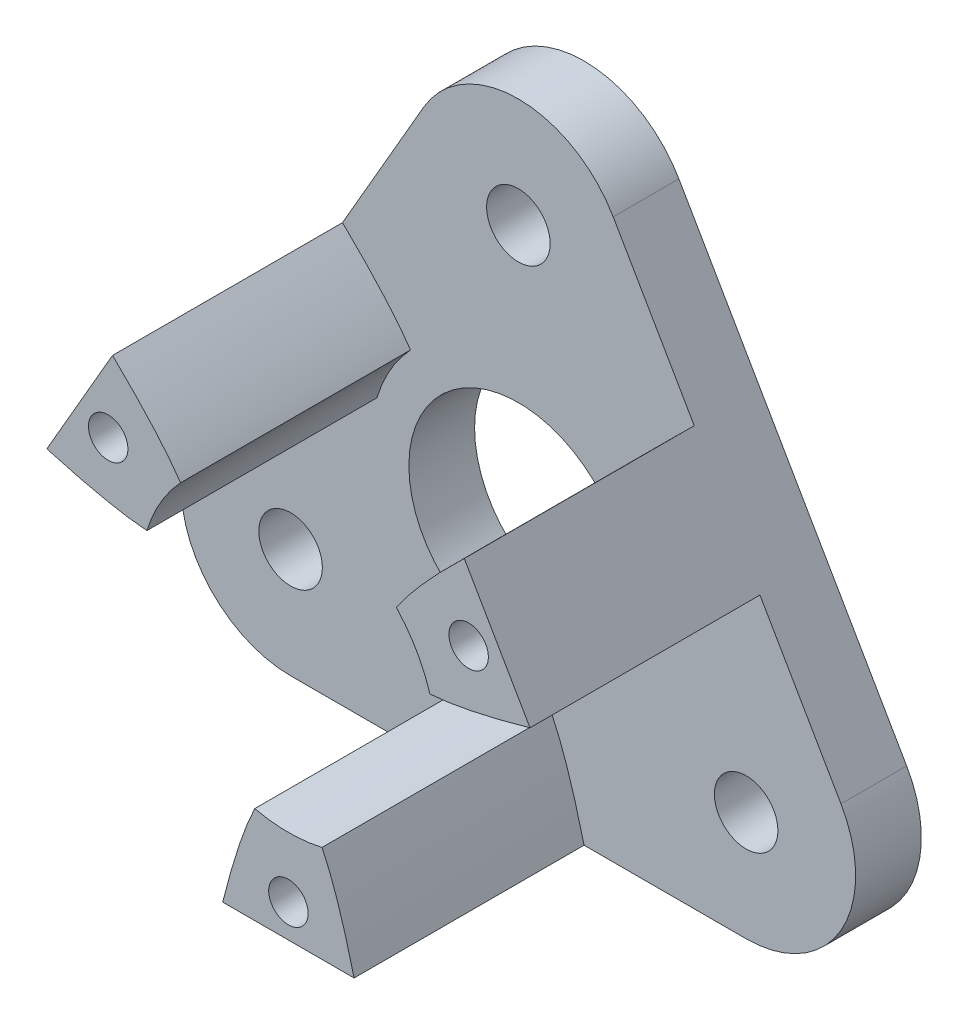
ISO-10303-21;
HEADER;
FILE_DESCRIPTION(('STEP AP214'),'2;1');
FILE_NAME('part.step','',(''),(''),'','','');
FILE_SCHEMA(('AUTOMOTIVE_DESIGN { 1 0 10303 214 1 1 1 1 }'));
ENDSEC;
DATA;
#1=APPLICATION_CONTEXT('core data for automotive mechanical design processes');
#2=APPLICATION_PROTOCOL_DEFINITION('international standard','automotive_design',2000,#1);
#3=PRODUCT_CONTEXT('',#1,'mechanical');
#4=PRODUCT('Part','Part','',(#3));
#5=PRODUCT_RELATED_PRODUCT_CATEGORY('part','',(#4));
#6=PRODUCT_DEFINITION_FORMATION('','',#4);
#7=PRODUCT_DEFINITION_CONTEXT('part definition',#1,'design');
#8=PRODUCT_DEFINITION('design','',#6,#7);
#9=PRODUCT_DEFINITION_SHAPE('','',#8);
#10=(LENGTH_UNIT() NAMED_UNIT(*) SI_UNIT(.MILLI.,.METRE.));
#11=(NAMED_UNIT(*) PLANE_ANGLE_UNIT() SI_UNIT($,.RADIAN.));
#12=(NAMED_UNIT(*) SI_UNIT($,.STERADIAN.) SOLID_ANGLE_UNIT());
#13=UNCERTAINTY_MEASURE_WITH_UNIT(LENGTH_MEASURE(1.E-05),#10,'distance_accuracy_value','');
#14=(GEOMETRIC_REPRESENTATION_CONTEXT(3) GLOBAL_UNCERTAINTY_ASSIGNED_CONTEXT((#13)) GLOBAL_UNIT_ASSIGNED_CONTEXT((#10,
#11,#12)) REPRESENTATION_CONTEXT('',''));
#15=CARTESIAN_POINT('',(0.,0.,0.));
#16=DIRECTION('',(0.,0.,1.));
#17=DIRECTION('',(1.,0.,0.));
#18=AXIS2_PLACEMENT_3D('',#15,#16,#17);
#19=CARTESIAN_POINT('',(8.03012701892221,8.1002976111394,13.5));
#20=CARTESIAN_POINT('',(-0.869872981077836,-0.50222139978608,13.5));
#21=CARTESIAN_POINT('',(11.0301270189222,2.90414518843278,13.5));
#22=B_SPLINE_CURVE_WITH_KNOTS('',2,(#19,#20,#21),.UNSPECIFIED.,.F.,.F.,(3,3),(0.,1.),.UNSPECIFIED.);
#23=DIRECTION('',(0.,0.,-1.));
#24=VECTOR('',#23,1.);
#25=SURFACE_OF_LINEAR_EXTRUSION('',#22,#24);
#26=DIRECTION('',(0.,0.,-1.));
#27=VECTOR('',#26,1.);
#28=CARTESIAN_POINT('',(4.92465367392024,4.61630655307291,13.5));
#29=LINE('',#28,#27);
#30=CARTESIAN_POINT('',(4.92465367392024,4.61630655307291,13.5));
#31=VERTEX_POINT('',#30);
#32=CARTESIAN_POINT('',(4.92465367392024,4.61630655307291,3.));
#33=VERTEX_POINT('',#32);
#34=EDGE_CURVE('E156',#31,#33,#29,.T.);
#35=ORIENTED_EDGE('',*,*,#34,.F.);
#36=CARTESIAN_POINT('',(8.03012701892221,8.1002976111394,13.5));
#37=VERTEX_POINT('',#36);
#38=EDGE_CURVE('E168',#37,#31,#22,.T.);
#39=ORIENTED_EDGE('',*,*,#38,.F.);
#40=DIRECTION('',(0.,0.,-1.));
#41=VECTOR('',#40,1.);
#42=CARTESIAN_POINT('',(8.03012701892221,8.1002976111394,13.5));
#43=LINE('',#42,#41);
#44=CARTESIAN_POINT('',(8.0301270189222,8.1002976111394,3.));
#45=VERTEX_POINT('',#44);
#46=EDGE_CURVE('E178',#37,#45,#43,.T.);
#47=ORIENTED_EDGE('',*,*,#46,.T.);
#48=CARTESIAN_POINT('',(8.03012701892221,8.1002976111394,3.));
#49=CARTESIAN_POINT('',(-0.869872981077836,-0.50222139978608,3.));
#50=CARTESIAN_POINT('',(11.0301270189222,2.90414518843278,3.));
#51=B_SPLINE_CURVE_WITH_KNOTS('',2,(#48,#49,#50),.UNSPECIFIED.,.F.,.F.,(3,3),(0.,1.),.UNSPECIFIED.);
#52=EDGE_CURVE('E169',#45,#33,#51,.T.);
#53=ORIENTED_EDGE('',*,*,#52,.T.);
#54=EDGE_LOOP('',(#35,#39,#47,#53));
#55=FACE_BOUND('',#54,.T.);
#56=ADVANCED_FACE('F32',(#55),#25,.F.);
#57=DIRECTION('',(0.,0.,-1.));
#58=VECTOR('',#57,1.);
#59=CARTESIAN_POINT('',(6.46016558357783,1.95672190991886,13.5));
#60=LINE('',#59,#58);
#61=CARTESIAN_POINT('',(6.46016558357783,1.95672190991886,3.));
#62=VERTEX_POINT('',#61);
#63=CARTESIAN_POINT('',(6.46016558357783,1.95672190991886,13.5));
#64=VERTEX_POINT('',#63);
#65=EDGE_CURVE('E47',#62,#64,#60,.F.);
#66=ORIENTED_EDGE('',*,*,#65,.F.);
#67=CARTESIAN_POINT('',(11.0301270189222,2.90414518843278,3.));
#68=VERTEX_POINT('',#67);
#69=EDGE_CURVE('E40',#62,#68,#51,.T.);
#70=ORIENTED_EDGE('',*,*,#69,.T.);
#71=DIRECTION('',(0.,0.,-1.));
#72=VECTOR('',#71,1.);
#73=CARTESIAN_POINT('',(11.0301270189222,2.90414518843278,13.5));
#74=LINE('',#73,#72);
#75=CARTESIAN_POINT('',(11.0301270189222,2.90414518843278,13.5));
#76=VERTEX_POINT('',#75);
#77=EDGE_CURVE('E414',#76,#68,#74,.T.);
#78=ORIENTED_EDGE('',*,*,#77,.F.);
#79=EDGE_CURVE('E176',#64,#76,#22,.T.);
#80=ORIENTED_EDGE('',*,*,#79,.F.);
#81=EDGE_LOOP('',(#66,#70,#78,#80));
#82=FACE_BOUND('',#81,.T.);
#83=ADVANCED_FACE('F194',(#82),#25,.F.);
#84=CARTESIAN_POINT('',(3.00000000000033,-11.0044427995723,13.5));
#85=CARTESIAN_POINT('',(-2.3763001115451E-13,1.00444279957233,13.5));
#86=CARTESIAN_POINT('',(-2.99999999999967,-11.0044427995723,13.5));
#87=B_SPLINE_CURVE_WITH_KNOTS('',2,(#84,#85,#86),.UNSPECIFIED.,.F.,.F.,(3,3),(0.,1.),.UNSPECIFIED.);
#88=DIRECTION('',(0.,0.,-1.));
#89=VECTOR('',#88,1.);
#90=SURFACE_OF_LINEAR_EXTRUSION('',#87,#89);
#91=DIRECTION('',(0.,0.,-1.));
#92=VECTOR('',#91,1.);
#93=CARTESIAN_POINT('',(1.53551190965768,-6.57302846299173,13.5));
#94=LINE('',#93,#92);
#95=CARTESIAN_POINT('',(1.53551190965768,-6.57302846299173,13.5));
#96=VERTEX_POINT('',#95);
#97=CARTESIAN_POINT('',(1.53551190965768,-6.57302846299173,3.));
#98=VERTEX_POINT('',#97);
#99=EDGE_CURVE('E467',#96,#98,#94,.T.);
#100=ORIENTED_EDGE('',*,*,#99,.F.);
#101=CARTESIAN_POINT('',(3.00000000000033,-11.0044427995723,13.5));
#102=VERTEX_POINT('',#101);
#103=EDGE_CURVE('E303',#102,#96,#87,.T.);
#104=ORIENTED_EDGE('',*,*,#103,.F.);
#105=DIRECTION('',(0.,0.,-1.));
#106=VECTOR('',#105,1.);
#107=CARTESIAN_POINT('',(3.00000000000033,-11.0044427995723,13.5));
#108=LINE('',#107,#106);
#109=CARTESIAN_POINT('',(3.00000000000033,-11.0044427995723,3.));
#110=VERTEX_POINT('',#109);
#111=EDGE_CURVE('E294',#102,#110,#108,.T.);
#112=ORIENTED_EDGE('',*,*,#111,.T.);
#113=CARTESIAN_POINT('',(3.00000000000033,-11.0044427995723,3.));
#114=CARTESIAN_POINT('',(-2.3763001115451E-13,1.00444279957233,3.));
#115=CARTESIAN_POINT('',(-2.99999999999967,-11.0044427995723,3.));
#116=B_SPLINE_CURVE_WITH_KNOTS('',2,(#113,#114,#115),.UNSPECIFIED.,.F.,.F.,(3,3),(0.,1.),.UNSPECIFIED.);
#117=EDGE_CURVE('E306',#110,#98,#116,.T.);
#118=ORIENTED_EDGE('',*,*,#117,.T.);
#119=EDGE_LOOP('',(#100,#104,#112,#118));
#120=FACE_BOUND('',#119,.T.);
#121=ADVANCED_FACE('F325',(#120),#90,.F.);
#122=DIRECTION('',(0.,0.,-1.));
#123=VECTOR('',#122,1.);
#124=CARTESIAN_POINT('',(-1.53551190965746,-6.57302846299178,13.5));
#125=LINE('',#124,#123);
#126=CARTESIAN_POINT('',(-1.53551190965746,-6.57302846299178,3.));
#127=VERTEX_POINT('',#126);
#128=CARTESIAN_POINT('',(-1.53551190965746,-6.57302846299178,13.5));
#129=VERTEX_POINT('',#128);
#130=EDGE_CURVE('E55',#127,#129,#125,.F.);
#131=ORIENTED_EDGE('',*,*,#130,.F.);
#132=CARTESIAN_POINT('',(-2.99999999999967,-11.0044427995721,3.));
#133=VERTEX_POINT('',#132);
#134=EDGE_CURVE('E310',#127,#133,#116,.T.);
#135=ORIENTED_EDGE('',*,*,#134,.T.);
#136=DIRECTION('',(0.,0.,-1.));
#137=VECTOR('',#136,1.);
#138=CARTESIAN_POINT('',(-2.99999999999967,-11.0044427995723,13.5));
#139=LINE('',#138,#137);
#140=CARTESIAN_POINT('',(-2.99999999999967,-11.0044427995723,13.5));
#141=VERTEX_POINT('',#140);
#142=EDGE_CURVE('E184',#141,#133,#139,.T.);
#143=ORIENTED_EDGE('',*,*,#142,.F.);
#144=EDGE_CURVE('E309',#129,#141,#87,.T.);
#145=ORIENTED_EDGE('',*,*,#144,.F.);
#146=EDGE_LOOP('',(#131,#135,#143,#145));
#147=FACE_BOUND('',#146,.T.);
#148=ADVANCED_FACE('F328',(#147),#90,.F.);
#149=CARTESIAN_POINT('',(-11.0301270189222,2.90414518843237,13.5));
#150=CARTESIAN_POINT('',(0.869872981077829,-0.502221399785746,13.5));
#151=CARTESIAN_POINT('',(-8.03012701892225,8.10029761113902,13.5));
#152=B_SPLINE_CURVE_WITH_KNOTS('',2,(#149,#150,#151),.UNSPECIFIED.,.F.,.F.,(3,3),(0.,1.),.UNSPECIFIED.);
#153=DIRECTION('',(0.,0.,-1.));
#154=VECTOR('',#153,1.);
#155=SURFACE_OF_LINEAR_EXTRUSION('',#152,#154);
#156=DIRECTION('',(0.,0.,-1.));
#157=VECTOR('',#156,1.);
#158=CARTESIAN_POINT('',(-6.46016558357787,1.95672190991873,13.5));
#159=LINE('',#158,#157);
#160=CARTESIAN_POINT('',(-6.46016558357787,1.95672190991873,13.5));
#161=VERTEX_POINT('',#160);
#162=CARTESIAN_POINT('',(-6.46016558357787,1.95672190991873,3.));
#163=VERTEX_POINT('',#162);
#164=EDGE_CURVE('E465',#161,#163,#159,.T.);
#165=ORIENTED_EDGE('',*,*,#164,.F.);
#166=CARTESIAN_POINT('',(-11.0301270189222,2.90414518843237,13.5));
#167=VERTEX_POINT('',#166);
#168=EDGE_CURVE('E340',#167,#161,#152,.T.);
#169=ORIENTED_EDGE('',*,*,#168,.F.);
#170=DIRECTION('',(0.,0.,-1.));
#171=VECTOR('',#170,1.);
#172=CARTESIAN_POINT('',(-11.0301270189222,2.90414518843237,13.5));
#173=LINE('',#172,#171);
#174=CARTESIAN_POINT('',(-11.0301270189222,2.90414518843237,3.));
#175=VERTEX_POINT('',#174);
#176=EDGE_CURVE('E353',#167,#175,#173,.T.);
#177=ORIENTED_EDGE('',*,*,#176,.T.);
#178=CARTESIAN_POINT('',(-11.0301270189222,2.90414518843237,3.));
#179=CARTESIAN_POINT('',(0.869872981077829,-0.502221399785746,3.));
#180=CARTESIAN_POINT('',(-8.03012701892225,8.10029761113902,3.));
#181=B_SPLINE_CURVE_WITH_KNOTS('',2,(#178,#179,#180),.UNSPECIFIED.,.F.,.F.,(3,3),(0.,1.),.UNSPECIFIED.);
#182=EDGE_CURVE('E354',#175,#163,#181,.T.);
#183=ORIENTED_EDGE('',*,*,#182,.T.);
#184=EDGE_LOOP('',(#165,#169,#177,#183));
#185=FACE_BOUND('',#184,.T.);
#186=ADVANCED_FACE('F334',(#185),#155,.F.);
#187=DIRECTION('',(0.,0.,-1.));
#188=VECTOR('',#187,1.);
#189=CARTESIAN_POINT('',(-4.9246536739203,4.61630655307284,13.5));
#190=LINE('',#189,#188);
#191=CARTESIAN_POINT('',(-4.9246536739203,4.61630655307284,3.));
#192=VERTEX_POINT('',#191);
#193=CARTESIAN_POINT('',(-4.92465367392029,4.61630655307283,13.5));
#194=VERTEX_POINT('',#193);
#195=EDGE_CURVE('E161',#192,#194,#190,.F.);
#196=ORIENTED_EDGE('',*,*,#195,.F.);
#197=CARTESIAN_POINT('',(-8.03012701892242,8.10029761113901,3.));
#198=VERTEX_POINT('',#197);
#199=EDGE_CURVE('E170',#192,#198,#181,.T.);
#200=ORIENTED_EDGE('',*,*,#199,.T.);
#201=DIRECTION('',(0.,0.,-1.));
#202=VECTOR('',#201,1.);
#203=CARTESIAN_POINT('',(-8.03012701892225,8.10029761113902,13.5));
#204=LINE('',#203,#202);
#205=CARTESIAN_POINT('',(-8.03012701892225,8.10029761113902,13.5));
#206=VERTEX_POINT('',#205);
#207=EDGE_CURVE('E320',#206,#198,#204,.T.);
#208=ORIENTED_EDGE('',*,*,#207,.F.);
#209=EDGE_CURVE('E347',#194,#206,#152,.T.);
#210=ORIENTED_EDGE('',*,*,#209,.F.);
#211=EDGE_LOOP('',(#196,#200,#208,#210));
#212=FACE_BOUND('',#211,.T.);
#213=ADVANCED_FACE('F217',(#212),#155,.F.);
#214=CARTESIAN_POINT('',(-10.4,-6.00444279957209,3.));
#215=DIRECTION('',(0.,0.,1.));
#216=DIRECTION('',(1.,0.,0.));
#217=AXIS2_PLACEMENT_3D('',#214,#215,#216);
#218=PLANE('',#217);
#219=CARTESIAN_POINT('',(10.4,-6.00444279957208,3.));
#220=DIRECTION('',(0.,0.,1.));
#221=DIRECTION('',(1.,0.,0.));
#222=AXIS2_PLACEMENT_3D('',#219,#220,#221);
#223=CIRCLE('',#222,1.45);
#224=CARTESIAN_POINT('',(11.85,-6.00444279957208,3.));
#225=VERTEX_POINT('',#224);
#226=EDGE_CURVE('E402',#225,#225,#223,.T.);
#227=ORIENTED_EDGE('',*,*,#226,.F.);
#228=EDGE_LOOP('',(#227));
#229=FACE_BOUND('',#228,.T.);
#230=ORIENTED_EDGE('',*,*,#69,.F.);
#231=CARTESIAN_POINT('',(0.,0.,3.));
#232=DIRECTION('',(0.,0.,1.));
#233=DIRECTION('',(1.,0.,0.));
#234=AXIS2_PLACEMENT_3D('',#231,#232,#233);
#235=CIRCLE('',#234,6.75);
#236=EDGE_CURVE('E422',#62,#33,#235,.T.);
#237=ORIENTED_EDGE('',*,*,#236,.T.);
#238=ORIENTED_EDGE('',*,*,#52,.F.);
#239=DIRECTION('',(-0.500000000000001,0.866025403784438,0.));
#240=VECTOR('',#239,1.);
#241=CARTESIAN_POINT('',(4.33012701892219,14.5088855991442,3.));
#242=LINE('',#241,#240);
#243=CARTESIAN_POINT('',(4.33012701892219,14.5088855991442,3.));
#244=VERTEX_POINT('',#243);
#245=EDGE_CURVE('E380',#45,#244,#242,.T.);
#246=ORIENTED_EDGE('',*,*,#245,.T.);
#247=CARTESIAN_POINT('',(0.,12.0088855991442,3.));
#248=DIRECTION('',(0.,0.,1.));
#249=DIRECTION('',(1.,0.,0.));
#250=AXIS2_PLACEMENT_3D('',#247,#248,#249);
#251=CIRCLE('',#250,5.);
#252=CARTESIAN_POINT('',(-4.33012701892219,14.5088855991442,3.));
#253=VERTEX_POINT('',#252);
#254=EDGE_CURVE('E387',#244,#253,#251,.T.);
#255=ORIENTED_EDGE('',*,*,#254,.T.);
#256=DIRECTION('',(-0.500000000000001,-0.866025403784438,0.));
#257=VECTOR('',#256,1.);
#258=CARTESIAN_POINT('',(-14.7301270189222,-3.50444279957208,3.));
#259=LINE('',#258,#257);
#260=EDGE_CURVE('E280',#253,#198,#259,.T.);
#261=ORIENTED_EDGE('',*,*,#260,.T.);
#262=ORIENTED_EDGE('',*,*,#199,.F.);
#263=EDGE_CURVE('E423',#192,#163,#235,.T.);
#264=ORIENTED_EDGE('',*,*,#263,.T.);
#265=ORIENTED_EDGE('',*,*,#182,.F.);
#266=CARTESIAN_POINT('',(-14.7301270189222,-3.50444279957208,3.));
#267=VERTEX_POINT('',#266);
#268=EDGE_CURVE('E389',#175,#267,#259,.T.);
#269=ORIENTED_EDGE('',*,*,#268,.T.);
#270=CARTESIAN_POINT('',(-10.4,-6.00444279957209,3.));
#271=DIRECTION('',(0.,0.,1.));
#272=DIRECTION('',(1.,0.,0.));
#273=AXIS2_PLACEMENT_3D('',#270,#271,#272);
#274=CIRCLE('',#273,5.);
#275=CARTESIAN_POINT('',(-10.4,-11.0044427995721,3.));
#276=VERTEX_POINT('',#275);
#277=EDGE_CURVE('E275',#267,#276,#274,.T.);
#278=ORIENTED_EDGE('',*,*,#277,.T.);
#279=DIRECTION('',(1.,0.,0.));
#280=VECTOR('',#279,1.);
#281=CARTESIAN_POINT('',(10.4,-11.0044427995721,3.));
#282=LINE('',#281,#280);
#283=EDGE_CURVE('E375',#276,#133,#282,.T.);
#284=ORIENTED_EDGE('',*,*,#283,.T.);
#285=ORIENTED_EDGE('',*,*,#134,.F.);
#286=EDGE_CURVE('E425',#127,#98,#235,.T.);
#287=ORIENTED_EDGE('',*,*,#286,.T.);
#288=ORIENTED_EDGE('',*,*,#117,.F.);
#289=CARTESIAN_POINT('',(10.4,-11.0044427995721,3.));
#290=VERTEX_POINT('',#289);
#291=EDGE_CURVE('E378',#110,#290,#282,.T.);
#292=ORIENTED_EDGE('',*,*,#291,.T.);
#293=CARTESIAN_POINT('',(10.4,-6.00444279957208,3.));
#294=DIRECTION('',(0.,0.,1.));
#295=DIRECTION('',(1.,0.,0.));
#296=AXIS2_PLACEMENT_3D('',#293,#294,#295);
#297=CIRCLE('',#296,5.);
#298=CARTESIAN_POINT('',(14.7301270189222,-3.50444279957207,3.));
#299=VERTEX_POINT('',#298);
#300=EDGE_CURVE('E260',#290,#299,#297,.T.);
#301=ORIENTED_EDGE('',*,*,#300,.T.);
#302=EDGE_CURVE('E385',#299,#68,#242,.T.);
#303=ORIENTED_EDGE('',*,*,#302,.T.);
#304=EDGE_LOOP('',(#230,#237,#238,#246,#255,#261,#262,#264,#265,#269,#278,#284,#285,#287,#288,
#292,#301,#303));
#305=FACE_BOUND('',#304,.T.);
#306=CARTESIAN_POINT('',(0.,0.,3.));
#307=DIRECTION('',(0.,0.,1.));
#308=DIRECTION('',(1.,0.,0.));
#309=AXIS2_PLACEMENT_3D('',#306,#307,#308);
#310=CIRCLE('',#309,5.);
#311=CARTESIAN_POINT('',(5.,0.,3.));
#312=VERTEX_POINT('',#311);
#313=EDGE_CURVE('E408',#312,#312,#310,.T.);
#314=ORIENTED_EDGE('',*,*,#313,.F.);
#315=EDGE_LOOP('',(#314));
#316=FACE_BOUND('',#315,.T.);
#317=CARTESIAN_POINT('',(-10.4,-6.00444279957209,3.));
#318=DIRECTION('',(0.,0.,1.));
#319=DIRECTION('',(1.,0.,0.));
#320=AXIS2_PLACEMENT_3D('',#317,#318,#319);
#321=CIRCLE('',#320,1.45);
#322=CARTESIAN_POINT('',(-8.95000000000003,-6.00444279957209,3.));
#323=VERTEX_POINT('',#322);
#324=EDGE_CURVE('E397',#323,#323,#321,.T.);
#325=ORIENTED_EDGE('',*,*,#324,.F.);
#326=EDGE_LOOP('',(#325));
#327=FACE_BOUND('',#326,.T.);
#328=CARTESIAN_POINT('',(0.,12.0088855991442,3.));
#329=DIRECTION('',(0.,0.,1.));
#330=DIRECTION('',(1.,0.,0.));
#331=AXIS2_PLACEMENT_3D('',#328,#329,#330);
#332=CIRCLE('',#331,1.45);
#333=CARTESIAN_POINT('',(1.45,12.0088855991442,3.));
#334=VERTEX_POINT('',#333);
#335=EDGE_CURVE('E391',#334,#334,#332,.T.);
#336=ORIENTED_EDGE('',*,*,#335,.F.);
#337=EDGE_LOOP('',(#336));
#338=FACE_BOUND('',#337,.T.);
#339=ADVANCED_FACE('F213',(#229,#305,#316,#327,#338),#218,.T.);
#340=CARTESIAN_POINT('',(-10.4,-6.00444279957209,0.));
#341=DIRECTION('',(0.,0.,1.));
#342=DIRECTION('',(1.,0.,0.));
#343=AXIS2_PLACEMENT_3D('',#340,#341,#342);
#344=PLANE('',#343);
#345=CARTESIAN_POINT('',(8.22916512459886,4.75111069989305,0.));
#346=DIRECTION('',(0.,0.,1.));
#347=DIRECTION('',(1.,0.,0.));
#348=AXIS2_PLACEMENT_3D('',#345,#346,#347);
#349=CIRCLE('',#348,0.9);
#350=CARTESIAN_POINT('',(9.12916512459886,4.75111069989305,0.));
#351=VERTEX_POINT('',#350);
#352=EDGE_CURVE('E428',#351,#351,#349,.T.);
#353=ORIENTED_EDGE('',*,*,#352,.T.);
#354=EDGE_LOOP('',(#353));
#355=FACE_BOUND('',#354,.T.);
#356=CARTESIAN_POINT('',(6.19192871367429E-13,-9.50222139978642,0.));
#357=DIRECTION('',(0.,0.,1.));
#358=DIRECTION('',(1.,0.,0.));
#359=AXIS2_PLACEMENT_3D('',#356,#357,#358);
#360=CIRCLE('',#359,0.89999999999981);
#361=CARTESIAN_POINT('',(0.900000000000429,-9.50222139978642,0.));
#362=VERTEX_POINT('',#361);
#363=EDGE_CURVE('E435',#362,#362,#360,.T.);
#364=ORIENTED_EDGE('',*,*,#363,.T.);
#365=EDGE_LOOP('',(#364));
#366=FACE_BOUND('',#365,.T.);
#367=CARTESIAN_POINT('',(-8.22916512459889,4.75111069989233,0.));
#368=DIRECTION('',(0.,0.,1.));
#369=DIRECTION('',(1.,0.,0.));
#370=AXIS2_PLACEMENT_3D('',#367,#368,#369);
#371=CIRCLE('',#370,0.900000000000481);
#372=CARTESIAN_POINT('',(-7.3291651245984,4.75111069989233,0.));
#373=VERTEX_POINT('',#372);
#374=EDGE_CURVE('E443',#373,#373,#371,.T.);
#375=ORIENTED_EDGE('',*,*,#374,.T.);
#376=EDGE_LOOP('',(#375));
#377=FACE_BOUND('',#376,.T.);
#378=CARTESIAN_POINT('',(-10.4,-6.00444279957209,0.));
#379=DIRECTION('',(0.,0.,1.));
#380=DIRECTION('',(1.,0.,0.));
#381=AXIS2_PLACEMENT_3D('',#378,#379,#380);
#382=CIRCLE('',#381,5.);
#383=CARTESIAN_POINT('',(-14.7301270189222,-3.50444279957208,0.));
#384=VERTEX_POINT('',#383);
#385=CARTESIAN_POINT('',(-10.4,-11.0044427995721,0.));
#386=VERTEX_POINT('',#385);
#387=EDGE_CURVE('E256',#384,#386,#382,.T.);
#388=ORIENTED_EDGE('',*,*,#387,.F.);
#389=DIRECTION('',(-0.500000000000001,-0.866025403784438,0.));
#390=VECTOR('',#389,1.);
#391=CARTESIAN_POINT('',(-14.7301270189222,-3.50444279957208,0.));
#392=LINE('',#391,#390);
#393=CARTESIAN_POINT('',(-4.33012701892219,14.5088855991442,0.));
#394=VERTEX_POINT('',#393);
#395=EDGE_CURVE('E273',#394,#384,#392,.T.);
#396=ORIENTED_EDGE('',*,*,#395,.F.);
#397=CARTESIAN_POINT('',(0.,12.0088855991442,0.));
#398=DIRECTION('',(0.,0.,1.));
#399=DIRECTION('',(1.,0.,0.));
#400=AXIS2_PLACEMENT_3D('',#397,#398,#399);
#401=CIRCLE('',#400,5.);
#402=CARTESIAN_POINT('',(4.33012701892219,14.5088855991442,0.));
#403=VERTEX_POINT('',#402);
#404=EDGE_CURVE('E268',#403,#394,#401,.T.);
#405=ORIENTED_EDGE('',*,*,#404,.F.);
#406=DIRECTION('',(-0.500000000000001,0.866025403784438,0.));
#407=VECTOR('',#406,1.);
#408=CARTESIAN_POINT('',(4.33012701892219,14.5088855991442,0.));
#409=LINE('',#408,#407);
#410=CARTESIAN_POINT('',(14.7301270189222,-3.50444279957207,0.));
#411=VERTEX_POINT('',#410);
#412=EDGE_CURVE('E266',#411,#403,#409,.T.);
#413=ORIENTED_EDGE('',*,*,#412,.F.);
#414=CARTESIAN_POINT('',(10.4,-6.00444279957208,0.));
#415=DIRECTION('',(0.,0.,1.));
#416=DIRECTION('',(1.,0.,0.));
#417=AXIS2_PLACEMENT_3D('',#414,#415,#416);
#418=CIRCLE('',#417,5.);
#419=CARTESIAN_POINT('',(10.4,-11.0044427995721,0.));
#420=VERTEX_POINT('',#419);
#421=EDGE_CURVE('E255',#420,#411,#418,.T.);
#422=ORIENTED_EDGE('',*,*,#421,.F.);
#423=DIRECTION('',(1.,0.,0.));
#424=VECTOR('',#423,1.);
#425=CARTESIAN_POINT('',(10.4,-11.0044427995721,0.));
#426=LINE('',#425,#424);
#427=EDGE_CURVE('E245',#386,#420,#426,.T.);
#428=ORIENTED_EDGE('',*,*,#427,.F.);
#429=EDGE_LOOP('',(#388,#396,#405,#413,#422,#428));
#430=FACE_BOUND('',#429,.T.);
#431=CARTESIAN_POINT('',(0.,12.0088855991442,0.));
#432=DIRECTION('',(0.,0.,1.));
#433=DIRECTION('',(1.,0.,0.));
#434=AXIS2_PLACEMENT_3D('',#431,#432,#433);
#435=CIRCLE('',#434,1.45);
#436=CARTESIAN_POINT('',(1.45,12.0088855991442,0.));
#437=VERTEX_POINT('',#436);
#438=EDGE_CURVE('E393',#437,#437,#435,.T.);
#439=ORIENTED_EDGE('',*,*,#438,.T.);
#440=EDGE_LOOP('',(#439));
#441=FACE_BOUND('',#440,.T.);
#442=CARTESIAN_POINT('',(-10.4,-6.00444279957209,0.));
#443=DIRECTION('',(0.,0.,1.));
#444=DIRECTION('',(1.,0.,0.));
#445=AXIS2_PLACEMENT_3D('',#442,#443,#444);
#446=CIRCLE('',#445,1.45);
#447=CARTESIAN_POINT('',(-8.95000000000003,-6.00444279957209,0.));
#448=VERTEX_POINT('',#447);
#449=EDGE_CURVE('E399',#448,#448,#446,.T.);
#450=ORIENTED_EDGE('',*,*,#449,.T.);
#451=EDGE_LOOP('',(#450));
#452=FACE_BOUND('',#451,.T.);
#453=CARTESIAN_POINT('',(10.4,-6.00444279957208,0.));
#454=DIRECTION('',(0.,0.,1.));
#455=DIRECTION('',(1.,0.,0.));
#456=AXIS2_PLACEMENT_3D('',#453,#454,#455);
#457=CIRCLE('',#456,1.45);
#458=CARTESIAN_POINT('',(11.85,-6.00444279957208,0.));
#459=VERTEX_POINT('',#458);
#460=EDGE_CURVE('E405',#459,#459,#457,.T.);
#461=ORIENTED_EDGE('',*,*,#460,.T.);
#462=EDGE_LOOP('',(#461));
#463=FACE_BOUND('',#462,.T.);
#464=CARTESIAN_POINT('',(0.,0.,0.));
#465=DIRECTION('',(0.,0.,1.));
#466=DIRECTION('',(1.,0.,0.));
#467=AXIS2_PLACEMENT_3D('',#464,#465,#466);
#468=CIRCLE('',#467,5.);
#469=CARTESIAN_POINT('',(5.,0.,0.));
#470=VERTEX_POINT('',#469);
#471=EDGE_CURVE('E411',#470,#470,#468,.T.);
#472=ORIENTED_EDGE('',*,*,#471,.T.);
#473=EDGE_LOOP('',(#472));
#474=FACE_BOUND('',#473,.T.);
#475=ADVANCED_FACE('F216',(#355,#366,#377,#430,#441,#452,#463,#474),#344,.F.);
#476=CARTESIAN_POINT('',(-10.4,-6.00444279957209,3.));
#477=DIRECTION('',(0.,0.,-1.));
#478=DIRECTION('',(-1.,0.,0.));
#479=AXIS2_PLACEMENT_3D('',#476,#477,#478);
#480=CYLINDRICAL_SURFACE('',#479,5.);
#481=ORIENTED_EDGE('',*,*,#387,.T.);
#482=DIRECTION('',(0.,0.,-1.));
#483=VECTOR('',#482,1.);
#484=CARTESIAN_POINT('',(-10.4,-11.0044427995721,3.));
#485=LINE('',#484,#483);
#486=EDGE_CURVE('E250',#276,#386,#485,.T.);
#487=ORIENTED_EDGE('',*,*,#486,.F.);
#488=ORIENTED_EDGE('',*,*,#277,.F.);
#489=DIRECTION('',(0.,0.,-1.));
#490=VECTOR('',#489,1.);
#491=CARTESIAN_POINT('',(-14.7301270189222,-3.50444279957208,3.));
#492=LINE('',#491,#490);
#493=EDGE_CURVE('E276',#267,#384,#492,.T.);
#494=ORIENTED_EDGE('',*,*,#493,.T.);
#495=EDGE_LOOP('',(#481,#487,#488,#494));
#496=FACE_BOUND('',#495,.T.);
#497=ADVANCED_FACE('F34',(#496),#480,.T.);
#498=CARTESIAN_POINT('',(10.4,-11.0044427995721,3.));
#499=DIRECTION('',(0.,1.,0.));
#500=DIRECTION('',(-1.,0.,0.));
#501=AXIS2_PLACEMENT_3D('',#498,#499,#500);
#502=PLANE('',#501);
#503=ORIENTED_EDGE('',*,*,#427,.T.);
#504=DIRECTION('',(0.,0.,-1.));
#505=VECTOR('',#504,1.);
#506=CARTESIAN_POINT('',(10.4,-11.0044427995721,3.));
#507=LINE('',#506,#505);
#508=EDGE_CURVE('E247',#290,#420,#507,.T.);
#509=ORIENTED_EDGE('',*,*,#508,.F.);
#510=ORIENTED_EDGE('',*,*,#291,.F.);
#511=ORIENTED_EDGE('',*,*,#111,.F.);
#512=DIRECTION('',(1.,0.,0.));
#513=VECTOR('',#512,1.);
#514=CARTESIAN_POINT('',(3.00000000000033,-11.0044427995723,13.5));
#515=LINE('',#514,#513);
#516=EDGE_CURVE('E298',#141,#102,#515,.T.);
#517=ORIENTED_EDGE('',*,*,#516,.F.);
#518=ORIENTED_EDGE('',*,*,#142,.T.);
#519=ORIENTED_EDGE('',*,*,#283,.F.);
#520=ORIENTED_EDGE('',*,*,#486,.T.);
#521=EDGE_LOOP('',(#503,#509,#510,#511,#517,#518,#519,#520));
#522=FACE_BOUND('',#521,.T.);
#523=ADVANCED_FACE('F235',(#522),#502,.F.);
#524=CARTESIAN_POINT('',(10.4,-6.00444279957208,3.));
#525=DIRECTION('',(0.,0.,-1.));
#526=DIRECTION('',(-1.,0.,0.));
#527=AXIS2_PLACEMENT_3D('',#524,#525,#526);
#528=CYLINDRICAL_SURFACE('',#527,5.);
#529=ORIENTED_EDGE('',*,*,#421,.T.);
#530=DIRECTION('',(0.,0.,-1.));
#531=VECTOR('',#530,1.);
#532=CARTESIAN_POINT('',(14.7301270189222,-3.50444279957207,3.));
#533=LINE('',#532,#531);
#534=EDGE_CURVE('E261',#299,#411,#533,.T.);
#535=ORIENTED_EDGE('',*,*,#534,.F.);
#536=ORIENTED_EDGE('',*,*,#300,.F.);
#537=ORIENTED_EDGE('',*,*,#508,.T.);
#538=EDGE_LOOP('',(#529,#535,#536,#537));
#539=FACE_BOUND('',#538,.T.);
#540=ADVANCED_FACE('F232',(#539),#528,.T.);
#541=CARTESIAN_POINT('',(4.33012701892219,14.5088855991442,3.));
#542=DIRECTION('',(-0.866025403784438,-0.500000000000001,0.));
#543=DIRECTION('',(0.500000000000001,-0.866025403784438,0.));
#544=AXIS2_PLACEMENT_3D('',#541,#542,#543);
#545=PLANE('',#544);
#546=ORIENTED_EDGE('',*,*,#412,.T.);
#547=DIRECTION('',(0.,0.,-1.));
#548=VECTOR('',#547,1.);
#549=CARTESIAN_POINT('',(4.33012701892219,14.5088855991442,3.));
#550=LINE('',#549,#548);
#551=EDGE_CURVE('E283',#244,#403,#550,.T.);
#552=ORIENTED_EDGE('',*,*,#551,.F.);
#553=ORIENTED_EDGE('',*,*,#245,.F.);
#554=ORIENTED_EDGE('',*,*,#46,.F.);
#555=DIRECTION('',(-0.500000000000002,0.866025403784437,0.));
#556=VECTOR('',#555,1.);
#557=CARTESIAN_POINT('',(8.03012701892221,8.1002976111394,13.5));
#558=LINE('',#557,#556);
#559=EDGE_CURVE('E174',#76,#37,#558,.T.);
#560=ORIENTED_EDGE('',*,*,#559,.F.);
#561=ORIENTED_EDGE('',*,*,#77,.T.);
#562=ORIENTED_EDGE('',*,*,#302,.F.);
#563=ORIENTED_EDGE('',*,*,#534,.T.);
#564=EDGE_LOOP('',(#546,#552,#553,#554,#560,#561,#562,#563));
#565=FACE_BOUND('',#564,.T.);
#566=ADVANCED_FACE('F228',(#565),#545,.F.);
#567=CARTESIAN_POINT('',(0.,12.0088855991442,3.));
#568=DIRECTION('',(0.,0.,-1.));
#569=DIRECTION('',(-1.,0.,0.));
#570=AXIS2_PLACEMENT_3D('',#567,#568,#569);
#571=CYLINDRICAL_SURFACE('',#570,5.);
#572=ORIENTED_EDGE('',*,*,#404,.T.);
#573=DIRECTION('',(0.,0.,-1.));
#574=VECTOR('',#573,1.);
#575=CARTESIAN_POINT('',(-4.33012701892219,14.5088855991442,3.));
#576=LINE('',#575,#574);
#577=EDGE_CURVE('E279',#253,#394,#576,.T.);
#578=ORIENTED_EDGE('',*,*,#577,.F.);
#579=ORIENTED_EDGE('',*,*,#254,.F.);
#580=ORIENTED_EDGE('',*,*,#551,.T.);
#581=EDGE_LOOP('',(#572,#578,#579,#580));
#582=FACE_BOUND('',#581,.T.);
#583=ADVANCED_FACE('F224',(#582),#571,.T.);
#584=CARTESIAN_POINT('',(-14.7301270189222,-3.50444279957208,3.));
#585=DIRECTION('',(0.866025403784438,-0.500000000000001,0.));
#586=DIRECTION('',(0.500000000000001,0.866025403784438,0.));
#587=AXIS2_PLACEMENT_3D('',#584,#585,#586);
#588=PLANE('',#587);
#589=ORIENTED_EDGE('',*,*,#395,.T.);
#590=ORIENTED_EDGE('',*,*,#493,.F.);
#591=ORIENTED_EDGE('',*,*,#268,.F.);
#592=ORIENTED_EDGE('',*,*,#176,.F.);
#593=DIRECTION('',(-0.499999999999997,-0.86602540378444,0.));
#594=VECTOR('',#593,1.);
#595=CARTESIAN_POINT('',(-11.0301270189222,2.90414518843237,13.5));
#596=LINE('',#595,#594);
#597=EDGE_CURVE('E346',#206,#167,#596,.T.);
#598=ORIENTED_EDGE('',*,*,#597,.F.);
#599=ORIENTED_EDGE('',*,*,#207,.T.);
#600=ORIENTED_EDGE('',*,*,#260,.F.);
#601=ORIENTED_EDGE('',*,*,#577,.T.);
#602=EDGE_LOOP('',(#589,#590,#591,#592,#598,#599,#600,#601));
#603=FACE_BOUND('',#602,.T.);
#604=ADVANCED_FACE('F211',(#603),#588,.F.);
#605=CARTESIAN_POINT('',(0.,12.0088855991442,3.));
#606=DIRECTION('',(0.,0.,-1.));
#607=DIRECTION('',(-1.,0.,0.));
#608=AXIS2_PLACEMENT_3D('',#605,#606,#607);
#609=CYLINDRICAL_SURFACE('',#608,1.45);
#610=ORIENTED_EDGE('',*,*,#335,.T.);
#611=EDGE_LOOP('',(#610));
#612=FACE_BOUND('',#611,.T.);
#613=ORIENTED_EDGE('',*,*,#438,.F.);
#614=EDGE_LOOP('',(#613));
#615=FACE_BOUND('',#614,.T.);
#616=ADVANCED_FACE('F207',(#612,#615),#609,.F.);
#617=CARTESIAN_POINT('',(-10.4,-6.00444279957209,3.));
#618=DIRECTION('',(0.,0.,-1.));
#619=DIRECTION('',(-1.,0.,0.));
#620=AXIS2_PLACEMENT_3D('',#617,#618,#619);
#621=CYLINDRICAL_SURFACE('',#620,1.45);
#622=ORIENTED_EDGE('',*,*,#324,.T.);
#623=EDGE_LOOP('',(#622));
#624=FACE_BOUND('',#623,.T.);
#625=ORIENTED_EDGE('',*,*,#449,.F.);
#626=EDGE_LOOP('',(#625));
#627=FACE_BOUND('',#626,.T.);
#628=ADVANCED_FACE('F203',(#624,#627),#621,.F.);
#629=CARTESIAN_POINT('',(10.4,-6.00444279957208,3.));
#630=DIRECTION('',(0.,0.,-1.));
#631=DIRECTION('',(-1.,0.,0.));
#632=AXIS2_PLACEMENT_3D('',#629,#630,#631);
#633=CYLINDRICAL_SURFACE('',#632,1.45);
#634=ORIENTED_EDGE('',*,*,#226,.T.);
#635=EDGE_LOOP('',(#634));
#636=FACE_BOUND('',#635,.T.);
#637=ORIENTED_EDGE('',*,*,#460,.F.);
#638=EDGE_LOOP('',(#637));
#639=FACE_BOUND('',#638,.T.);
#640=ADVANCED_FACE('F199',(#636,#639),#633,.F.);
#641=CARTESIAN_POINT('',(0.,0.,3.));
#642=DIRECTION('',(0.,0.,-1.));
#643=DIRECTION('',(-1.,0.,0.));
#644=AXIS2_PLACEMENT_3D('',#641,#642,#643);
#645=CYLINDRICAL_SURFACE('',#644,5.);
#646=ORIENTED_EDGE('',*,*,#313,.T.);
#647=EDGE_LOOP('',(#646));
#648=FACE_BOUND('',#647,.T.);
#649=ORIENTED_EDGE('',*,*,#471,.F.);
#650=EDGE_LOOP('',(#649));
#651=FACE_BOUND('',#650,.T.);
#652=ADVANCED_FACE('F196',(#648,#651),#645,.F.);
#653=CARTESIAN_POINT('',(4.33012701892219,2.50000000000001,13.5));
#654=DIRECTION('',(0.,0.,-1.));
#655=DIRECTION('',(-1.,0.,0.));
#656=AXIS2_PLACEMENT_3D('',#653,#654,#655);
#657=PLANE('',#656);
#658=CARTESIAN_POINT('',(8.22916512459886,4.75111069989305,13.5));
#659=DIRECTION('',(0.,0.,1.));
#660=DIRECTION('',(1.,0.,0.));
#661=AXIS2_PLACEMENT_3D('',#658,#659,#660);
#662=CIRCLE('',#661,0.9);
#663=CARTESIAN_POINT('',(9.12916512459886,4.75111069989305,13.5));
#664=VERTEX_POINT('',#663);
#665=EDGE_CURVE('E431',#664,#664,#662,.T.);
#666=ORIENTED_EDGE('',*,*,#665,.F.);
#667=EDGE_LOOP('',(#666));
#668=FACE_BOUND('',#667,.T.);
#669=CARTESIAN_POINT('',(0.,0.,13.5));
#670=DIRECTION('',(0.,0.,1.));
#671=DIRECTION('',(1.,0.,0.));
#672=AXIS2_PLACEMENT_3D('',#669,#670,#671);
#673=CIRCLE('',#672,6.75);
#674=EDGE_CURVE('E153',#64,#31,#673,.T.);
#675=ORIENTED_EDGE('',*,*,#674,.F.);
#676=ORIENTED_EDGE('',*,*,#79,.T.);
#677=ORIENTED_EDGE('',*,*,#559,.T.);
#678=ORIENTED_EDGE('',*,*,#38,.T.);
#679=EDGE_LOOP('',(#675,#676,#677,#678));
#680=FACE_BOUND('',#679,.T.);
#681=ADVANCED_FACE('F172',(#668,#680),#657,.F.);
#682=CARTESIAN_POINT('',(0.,-5.,13.5));
#683=DIRECTION('',(0.,0.,-1.));
#684=DIRECTION('',(-1.,0.,0.));
#685=AXIS2_PLACEMENT_3D('',#682,#683,#684);
#686=PLANE('',#685);
#687=CARTESIAN_POINT('',(6.19192871367429E-13,-9.50222139978642,13.5));
#688=DIRECTION('',(0.,0.,1.));
#689=DIRECTION('',(1.,0.,0.));
#690=AXIS2_PLACEMENT_3D('',#687,#688,#689);
#691=CIRCLE('',#690,0.89999999999981);
#692=CARTESIAN_POINT('',(0.900000000000429,-9.50222139978642,13.5));
#693=VERTEX_POINT('',#692);
#694=EDGE_CURVE('E440',#693,#693,#691,.T.);
#695=ORIENTED_EDGE('',*,*,#694,.F.);
#696=EDGE_LOOP('',(#695));
#697=FACE_BOUND('',#696,.T.);
#698=EDGE_CURVE('E162',#129,#96,#673,.T.);
#699=ORIENTED_EDGE('',*,*,#698,.F.);
#700=ORIENTED_EDGE('',*,*,#144,.T.);
#701=ORIENTED_EDGE('',*,*,#516,.T.);
#702=ORIENTED_EDGE('',*,*,#103,.T.);
#703=EDGE_LOOP('',(#699,#700,#701,#702));
#704=FACE_BOUND('',#703,.T.);
#705=ADVANCED_FACE('F329',(#697,#704),#686,.F.);
#706=CARTESIAN_POINT('',(-4.33012701892221,2.49999999999997,13.5));
#707=DIRECTION('',(0.,0.,-1.));
#708=DIRECTION('',(-1.,0.,0.));
#709=AXIS2_PLACEMENT_3D('',#706,#707,#708);
#710=PLANE('',#709);
#711=CARTESIAN_POINT('',(-8.22916512459889,4.75111069989233,13.5));
#712=DIRECTION('',(0.,0.,1.));
#713=DIRECTION('',(1.,0.,0.));
#714=AXIS2_PLACEMENT_3D('',#711,#712,#713);
#715=CIRCLE('',#714,0.900000000000481);
#716=CARTESIAN_POINT('',(-7.3291651245984,4.75111069989233,13.5));
#717=VERTEX_POINT('',#716);
#718=EDGE_CURVE('E446',#717,#717,#715,.T.);
#719=ORIENTED_EDGE('',*,*,#718,.F.);
#720=EDGE_LOOP('',(#719));
#721=FACE_BOUND('',#720,.T.);
#722=CARTESIAN_POINT('',(0.,0.,13.5));
#723=DIRECTION('',(0.,0.,-1.));
#724=DIRECTION('',(-1.,0.,0.));
#725=AXIS2_PLACEMENT_3D('',#722,#723,#724);
#726=CIRCLE('',#725,6.75);
#727=EDGE_CURVE('E11',#194,#161,#726,.F.);
#728=ORIENTED_EDGE('',*,*,#727,.F.);
#729=ORIENTED_EDGE('',*,*,#209,.T.);
#730=ORIENTED_EDGE('',*,*,#597,.T.);
#731=ORIENTED_EDGE('',*,*,#168,.T.);
#732=EDGE_LOOP('',(#728,#729,#730,#731));
#733=FACE_BOUND('',#732,.T.);
#734=ADVANCED_FACE('F332',(#721,#733),#710,.F.);
#735=CARTESIAN_POINT('',(0.,0.,13.5));
#736=DIRECTION('',(0.,0.,-1.));
#737=DIRECTION('',(-1.,0.,0.));
#738=AXIS2_PLACEMENT_3D('',#735,#736,#737);
#739=CYLINDRICAL_SURFACE('',#738,6.75);
#740=ORIENTED_EDGE('',*,*,#164,.T.);
#741=ORIENTED_EDGE('',*,*,#263,.F.);
#742=ORIENTED_EDGE('',*,*,#195,.T.);
#743=ORIENTED_EDGE('',*,*,#727,.T.);
#744=EDGE_LOOP('',(#740,#741,#742,#743));
#745=FACE_BOUND('',#744,.T.);
#746=ADVANCED_FACE('F454',(#745),#739,.F.);
#747=ORIENTED_EDGE('',*,*,#99,.T.);
#748=ORIENTED_EDGE('',*,*,#286,.F.);
#749=ORIENTED_EDGE('',*,*,#130,.T.);
#750=ORIENTED_EDGE('',*,*,#698,.T.);
#751=EDGE_LOOP('',(#747,#748,#749,#750));
#752=FACE_BOUND('',#751,.T.);
#753=ADVANCED_FACE('F471',(#752),#739,.F.);
#754=ORIENTED_EDGE('',*,*,#34,.T.);
#755=ORIENTED_EDGE('',*,*,#236,.F.);
#756=ORIENTED_EDGE('',*,*,#65,.T.);
#757=ORIENTED_EDGE('',*,*,#674,.T.);
#758=EDGE_LOOP('',(#754,#755,#756,#757));
#759=FACE_BOUND('',#758,.T.);
#760=ADVANCED_FACE('F155',(#759),#739,.F.);
#761=CARTESIAN_POINT('',(-8.22916512459889,4.75111069989233,0.));
#762=DIRECTION('',(0.,0.,1.));
#763=DIRECTION('',(1.,0.,0.));
#764=AXIS2_PLACEMENT_3D('',#761,#762,#763);
#765=CYLINDRICAL_SURFACE('',#764,0.900000000000481);
#766=ORIENTED_EDGE('',*,*,#374,.F.);
#767=EDGE_LOOP('',(#766));
#768=FACE_BOUND('',#767,.T.);
#769=ORIENTED_EDGE('',*,*,#718,.T.);
#770=EDGE_LOOP('',(#769));
#771=FACE_BOUND('',#770,.T.);
#772=ADVANCED_FACE('F450',(#768,#771),#765,.F.);
#773=CARTESIAN_POINT('',(6.19192871367429E-13,-9.50222139978642,0.));
#774=DIRECTION('',(0.,0.,1.));
#775=DIRECTION('',(1.,0.,0.));
#776=AXIS2_PLACEMENT_3D('',#773,#774,#775);
#777=CYLINDRICAL_SURFACE('',#776,0.89999999999981);
#778=ORIENTED_EDGE('',*,*,#363,.F.);
#779=EDGE_LOOP('',(#778));
#780=FACE_BOUND('',#779,.T.);
#781=ORIENTED_EDGE('',*,*,#694,.T.);
#782=EDGE_LOOP('',(#781));
#783=FACE_BOUND('',#782,.T.);
#784=ADVANCED_FACE('F601',(#780,#783),#777,.F.);
#785=CARTESIAN_POINT('',(8.22916512459886,4.75111069989305,0.));
#786=DIRECTION('',(0.,0.,1.));
#787=DIRECTION('',(1.,0.,0.));
#788=AXIS2_PLACEMENT_3D('',#785,#786,#787);
#789=CYLINDRICAL_SURFACE('',#788,0.9);
#790=ORIENTED_EDGE('',*,*,#352,.F.);
#791=EDGE_LOOP('',(#790));
#792=FACE_BOUND('',#791,.T.);
#793=ORIENTED_EDGE('',*,*,#665,.T.);
#794=EDGE_LOOP('',(#793));
#795=FACE_BOUND('',#794,.T.);
#796=ADVANCED_FACE('F611',(#792,#795),#789,.F.);
#797=CLOSED_SHELL('',(#56,#83,#121,#148,#186,#213,#339,#475,#497,#523,#540,#566,#583,#604,#616,
#628,#640,#652,#681,#705,#734,#746,#753,#760,#772,#784,#796));
#798=MANIFOLD_SOLID_BREP('B2',#797);
#799=ADVANCED_BREP_SHAPE_REPRESENTATION('',(#18,#798),#14);
#800=SHAPE_DEFINITION_REPRESENTATION(#9,#799);
ENDSEC;
END-ISO-10303-21;
